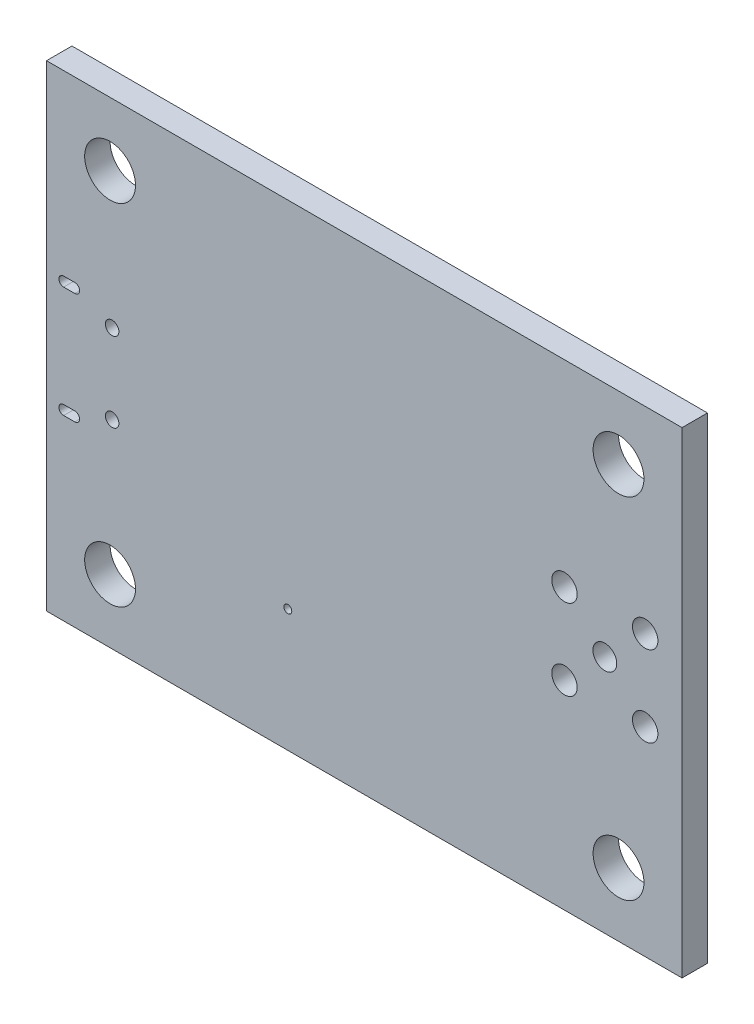
ISO-10303-21;
HEADER;
FILE_DESCRIPTION(('STEP AP214'),'2;1');
FILE_NAME('part.step','',(''),(''),'','','');
FILE_SCHEMA(('AUTOMOTIVE_DESIGN { 1 0 10303 214 1 1 1 1 }'));
ENDSEC;
DATA;
#1=APPLICATION_CONTEXT('core data for automotive mechanical design processes');
#2=APPLICATION_PROTOCOL_DEFINITION('international standard','automotive_design',2000,#1);
#3=PRODUCT_CONTEXT('',#1,'mechanical');
#4=PRODUCT('Part','Part','',(#3));
#5=PRODUCT_RELATED_PRODUCT_CATEGORY('part','',(#4));
#6=PRODUCT_DEFINITION_FORMATION('','',#4);
#7=PRODUCT_DEFINITION_CONTEXT('part definition',#1,'design');
#8=PRODUCT_DEFINITION('design','',#6,#7);
#9=PRODUCT_DEFINITION_SHAPE('','',#8);
#10=(LENGTH_UNIT() NAMED_UNIT(*) SI_UNIT(.MILLI.,.METRE.));
#11=(NAMED_UNIT(*) PLANE_ANGLE_UNIT() SI_UNIT($,.RADIAN.));
#12=(NAMED_UNIT(*) SI_UNIT($,.STERADIAN.) SOLID_ANGLE_UNIT());
#13=UNCERTAINTY_MEASURE_WITH_UNIT(LENGTH_MEASURE(1.E-05),#10,'distance_accuracy_value','');
#14=(GEOMETRIC_REPRESENTATION_CONTEXT(3) GLOBAL_UNCERTAINTY_ASSIGNED_CONTEXT((#13)) GLOBAL_UNIT_ASSIGNED_CONTEXT((#10,
#11,#12)) REPRESENTATION_CONTEXT('',''));
#15=CARTESIAN_POINT('',(0.,0.,0.));
#16=DIRECTION('',(0.,0.,1.));
#17=DIRECTION('',(1.,0.,0.));
#18=AXIS2_PLACEMENT_3D('',#15,#16,#17);
#19=CARTESIAN_POINT('',(1.0935,-11.507,0.));
#20=DIRECTION('',(0.,0.,-1.));
#21=DIRECTION('',(-1.,0.,0.));
#22=AXIS2_PLACEMENT_3D('',#19,#20,#21);
#23=CYLINDRICAL_SURFACE('',#22,0.3);
#24=CARTESIAN_POINT('',(1.0935,-11.507,1.6));
#25=DIRECTION('',(0.,0.,-1.));
#26=DIRECTION('',(-1.,0.,0.));
#27=AXIS2_PLACEMENT_3D('',#24,#25,#26);
#28=CIRCLE('',#27,0.3);
#29=CARTESIAN_POINT('',(1.0935,-11.807,1.6));
#30=VERTEX_POINT('',#29);
#31=CARTESIAN_POINT('',(1.0935,-11.207,1.6));
#32=VERTEX_POINT('',#31);
#33=EDGE_CURVE('E95',#30,#32,#28,.T.);
#34=ORIENTED_EDGE('',*,*,#33,.F.);
#35=DIRECTION('',(0.,0.,1.));
#36=VECTOR('',#35,1.);
#37=CARTESIAN_POINT('',(1.0935,-11.807,0.));
#38=LINE('',#37,#36);
#39=CARTESIAN_POINT('',(1.0935,-11.807,0.));
#40=VERTEX_POINT('',#39);
#41=EDGE_CURVE('E97',#40,#30,#38,.T.);
#42=ORIENTED_EDGE('',*,*,#41,.F.);
#43=CARTESIAN_POINT('',(1.0935,-11.507,0.));
#44=DIRECTION('',(0.,0.,-1.));
#45=DIRECTION('',(-1.,0.,0.));
#46=AXIS2_PLACEMENT_3D('',#43,#44,#45);
#47=CIRCLE('',#46,0.3);
#48=CARTESIAN_POINT('',(1.0935,-11.207,0.));
#49=VERTEX_POINT('',#48);
#50=EDGE_CURVE('E19',#49,#40,#47,.F.);
#51=ORIENTED_EDGE('',*,*,#50,.F.);
#52=DIRECTION('',(0.,0.,-1.));
#53=VECTOR('',#52,1.);
#54=CARTESIAN_POINT('',(1.0935,-11.207,0.));
#55=LINE('',#54,#53);
#56=EDGE_CURVE('E114',#32,#49,#55,.T.);
#57=ORIENTED_EDGE('',*,*,#56,.F.);
#58=EDGE_LOOP('',(#34,#42,#51,#57));
#59=FACE_BOUND('',#58,.T.);
#60=ADVANCED_FACE('F16',(#59),#23,.F.);
#61=CARTESIAN_POINT('',(1.7935,-18.507,0.));
#62=DIRECTION('',(0.,0.,-1.));
#63=DIRECTION('',(-1.,0.,0.));
#64=AXIS2_PLACEMENT_3D('',#61,#62,#63);
#65=CYLINDRICAL_SURFACE('',#64,0.3);
#66=CARTESIAN_POINT('',(1.7935,-18.507,1.6));
#67=DIRECTION('',(0.,0.,-1.));
#68=DIRECTION('',(-1.,0.,0.));
#69=AXIS2_PLACEMENT_3D('',#66,#67,#68);
#70=CIRCLE('',#69,0.3);
#71=CARTESIAN_POINT('',(1.7935,-18.207,1.6));
#72=VERTEX_POINT('',#71);
#73=CARTESIAN_POINT('',(1.7935,-18.807,1.6));
#74=VERTEX_POINT('',#73);
#75=EDGE_CURVE('E118',#72,#74,#70,.T.);
#76=ORIENTED_EDGE('',*,*,#75,.F.);
#77=DIRECTION('',(0.,0.,-1.));
#78=VECTOR('',#77,1.);
#79=CARTESIAN_POINT('',(1.7935,-18.207,0.));
#80=LINE('',#79,#78);
#81=CARTESIAN_POINT('',(1.7935,-18.207,0.));
#82=VERTEX_POINT('',#81);
#83=EDGE_CURVE('E115',#82,#72,#80,.F.);
#84=ORIENTED_EDGE('',*,*,#83,.F.);
#85=CARTESIAN_POINT('',(1.7935,-18.507,0.));
#86=DIRECTION('',(0.,0.,-1.));
#87=DIRECTION('',(-1.,0.,0.));
#88=AXIS2_PLACEMENT_3D('',#85,#86,#87);
#89=CIRCLE('',#88,0.3);
#90=CARTESIAN_POINT('',(1.7935,-18.807,0.));
#91=VERTEX_POINT('',#90);
#92=EDGE_CURVE('E205',#91,#82,#89,.F.);
#93=ORIENTED_EDGE('',*,*,#92,.F.);
#94=DIRECTION('',(0.,0.,1.));
#95=VECTOR('',#94,1.);
#96=CARTESIAN_POINT('',(1.7935,-18.807,0.));
#97=LINE('',#96,#95);
#98=EDGE_CURVE('E105',#74,#91,#97,.F.);
#99=ORIENTED_EDGE('',*,*,#98,.F.);
#100=EDGE_LOOP('',(#76,#84,#93,#99));
#101=FACE_BOUND('',#100,.T.);
#102=ADVANCED_FACE('F242',(#101),#65,.F.);
#103=CARTESIAN_POINT('',(1.7935,-11.207,0.));
#104=DIRECTION('',(0.,-1.,0.));
#105=DIRECTION('',(0.,0.,-1.));
#106=AXIS2_PLACEMENT_3D('',#103,#104,#105);
#107=PLANE('',#106);
#108=ORIENTED_EDGE('',*,*,#56,.T.);
#109=DIRECTION('',(1.,0.,0.));
#110=VECTOR('',#109,1.);
#111=CARTESIAN_POINT('',(1.7935,-11.207,0.));
#112=LINE('',#111,#110);
#113=CARTESIAN_POINT('',(1.7935,-11.207,0.));
#114=VERTEX_POINT('',#113);
#115=EDGE_CURVE('E93',#49,#114,#112,.T.);
#116=ORIENTED_EDGE('',*,*,#115,.T.);
#117=DIRECTION('',(0.,0.,-1.));
#118=VECTOR('',#117,1.);
#119=CARTESIAN_POINT('',(1.7935,-11.207,0.));
#120=LINE('',#119,#118);
#121=CARTESIAN_POINT('',(1.7935,-11.207,1.6));
#122=VERTEX_POINT('',#121);
#123=EDGE_CURVE('E181',#114,#122,#120,.F.);
#124=ORIENTED_EDGE('',*,*,#123,.T.);
#125=DIRECTION('',(-1.,0.,0.));
#126=VECTOR('',#125,1.);
#127=CARTESIAN_POINT('',(20.014,-11.207,1.6));
#128=LINE('',#127,#126);
#129=EDGE_CURVE('E211',#122,#32,#128,.T.);
#130=ORIENTED_EDGE('',*,*,#129,.T.);
#131=EDGE_LOOP('',(#108,#116,#124,#130));
#132=FACE_BOUND('',#131,.T.);
#133=ADVANCED_FACE('F215',(#132),#107,.T.);
#134=CARTESIAN_POINT('',(1.0935,-11.807,0.));
#135=DIRECTION('',(0.,1.,0.));
#136=DIRECTION('',(0.,0.,1.));
#137=AXIS2_PLACEMENT_3D('',#134,#135,#136);
#138=PLANE('',#137);
#139=DIRECTION('',(0.,0.,-1.));
#140=VECTOR('',#139,1.);
#141=CARTESIAN_POINT('',(1.7935,-11.807,0.));
#142=LINE('',#141,#140);
#143=CARTESIAN_POINT('',(1.7935,-11.807,1.6));
#144=VERTEX_POINT('',#143);
#145=CARTESIAN_POINT('',(1.7935,-11.807,0.));
#146=VERTEX_POINT('',#145);
#147=EDGE_CURVE('E103',#144,#146,#142,.T.);
#148=ORIENTED_EDGE('',*,*,#147,.T.);
#149=DIRECTION('',(1.,0.,0.));
#150=VECTOR('',#149,1.);
#151=CARTESIAN_POINT('',(1.0935,-11.807,0.));
#152=LINE('',#151,#150);
#153=EDGE_CURVE('E91',#146,#40,#152,.F.);
#154=ORIENTED_EDGE('',*,*,#153,.T.);
#155=ORIENTED_EDGE('',*,*,#41,.T.);
#156=DIRECTION('',(-1.,0.,0.));
#157=VECTOR('',#156,1.);
#158=CARTESIAN_POINT('',(20.014,-11.807,1.6));
#159=LINE('',#158,#157);
#160=EDGE_CURVE('E213',#30,#144,#159,.F.);
#161=ORIENTED_EDGE('',*,*,#160,.T.);
#162=EDGE_LOOP('',(#148,#154,#155,#161));
#163=FACE_BOUND('',#162,.T.);
#164=ADVANCED_FACE('F101',(#163),#138,.T.);
#165=CARTESIAN_POINT('',(1.0935,-18.807,0.));
#166=DIRECTION('',(0.,1.,0.));
#167=DIRECTION('',(0.,0.,1.));
#168=AXIS2_PLACEMENT_3D('',#165,#166,#167);
#169=PLANE('',#168);
#170=ORIENTED_EDGE('',*,*,#98,.T.);
#171=DIRECTION('',(1.,0.,0.));
#172=VECTOR('',#171,1.);
#173=CARTESIAN_POINT('',(1.0935,-18.807,0.));
#174=LINE('',#173,#172);
#175=CARTESIAN_POINT('',(1.0935,-18.807,0.));
#176=VERTEX_POINT('',#175);
#177=EDGE_CURVE('E108',#91,#176,#174,.F.);
#178=ORIENTED_EDGE('',*,*,#177,.T.);
#179=DIRECTION('',(0.,0.,-1.));
#180=VECTOR('',#179,1.);
#181=CARTESIAN_POINT('',(1.0935,-18.807,0.));
#182=LINE('',#181,#180);
#183=CARTESIAN_POINT('',(1.0935,-18.807,1.6));
#184=VERTEX_POINT('',#183);
#185=EDGE_CURVE('E174',#176,#184,#182,.F.);
#186=ORIENTED_EDGE('',*,*,#185,.T.);
#187=DIRECTION('',(-1.,0.,0.));
#188=VECTOR('',#187,1.);
#189=CARTESIAN_POINT('',(20.014,-18.807,1.6));
#190=LINE('',#189,#188);
#191=EDGE_CURVE('E217',#184,#74,#190,.F.);
#192=ORIENTED_EDGE('',*,*,#191,.T.);
#193=EDGE_LOOP('',(#170,#178,#186,#192));
#194=FACE_BOUND('',#193,.T.);
#195=ADVANCED_FACE('F239',(#194),#169,.T.);
#196=CARTESIAN_POINT('',(1.7935,-18.207,0.));
#197=DIRECTION('',(0.,-1.,0.));
#198=DIRECTION('',(0.,0.,-1.));
#199=AXIS2_PLACEMENT_3D('',#196,#197,#198);
#200=PLANE('',#199);
#201=DIRECTION('',(0.,0.,-1.));
#202=VECTOR('',#201,1.);
#203=CARTESIAN_POINT('',(1.0935,-18.207,0.));
#204=LINE('',#203,#202);
#205=CARTESIAN_POINT('',(1.0935,-18.207,1.6));
#206=VERTEX_POINT('',#205);
#207=CARTESIAN_POINT('',(1.0935,-18.207,0.));
#208=VERTEX_POINT('',#207);
#209=EDGE_CURVE('E170',#206,#208,#204,.T.);
#210=ORIENTED_EDGE('',*,*,#209,.T.);
#211=DIRECTION('',(1.,0.,0.));
#212=VECTOR('',#211,1.);
#213=CARTESIAN_POINT('',(1.7935,-18.207,0.));
#214=LINE('',#213,#212);
#215=EDGE_CURVE('E34',#208,#82,#214,.T.);
#216=ORIENTED_EDGE('',*,*,#215,.T.);
#217=ORIENTED_EDGE('',*,*,#83,.T.);
#218=DIRECTION('',(-1.,0.,0.));
#219=VECTOR('',#218,1.);
#220=CARTESIAN_POINT('',(20.014,-18.207,1.6));
#221=LINE('',#220,#219);
#222=EDGE_CURVE('E220',#72,#206,#221,.T.);
#223=ORIENTED_EDGE('',*,*,#222,.T.);
#224=EDGE_LOOP('',(#210,#216,#217,#223));
#225=FACE_BOUND('',#224,.T.);
#226=ADVANCED_FACE('F225',(#225),#200,.T.);
#227=CARTESIAN_POINT('',(20.014,-15.007,1.6));
#228=DIRECTION('',(0.,0.,-1.));
#229=DIRECTION('',(-1.,0.,0.));
#230=AXIS2_PLACEMENT_3D('',#227,#228,#229);
#231=PLANE('',#230);
#232=CARTESIAN_POINT('',(36.014,-4.007,1.6));
#233=DIRECTION('',(0.,0.,1.));
#234=DIRECTION('',(1.,0.,0.));
#235=AXIS2_PLACEMENT_3D('',#232,#233,#234);
#236=CIRCLE('',#235,1.6);
#237=CARTESIAN_POINT('',(37.614,-4.007,1.6));
#238=VERTEX_POINT('',#237);
#239=EDGE_CURVE('E157',#238,#238,#236,.F.);
#240=ORIENTED_EDGE('',*,*,#239,.T.);
#241=EDGE_LOOP('',(#240));
#242=FACE_BOUND('',#241,.T.);
#243=CARTESIAN_POINT('',(4.014,-4.007,1.6));
#244=DIRECTION('',(0.,0.,1.));
#245=DIRECTION('',(1.,0.,0.));
#246=AXIS2_PLACEMENT_3D('',#243,#244,#245);
#247=CIRCLE('',#246,1.6);
#248=CARTESIAN_POINT('',(5.614,-4.007,1.6));
#249=VERTEX_POINT('',#248);
#250=EDGE_CURVE('E161',#249,#249,#247,.F.);
#251=ORIENTED_EDGE('',*,*,#250,.T.);
#252=EDGE_LOOP('',(#251));
#253=FACE_BOUND('',#252,.T.);
#254=CARTESIAN_POINT('',(37.6936,-12.3952,1.6));
#255=DIRECTION('',(0.,0.,1.));
#256=DIRECTION('',(1.,0.,0.));
#257=AXIS2_PLACEMENT_3D('',#254,#255,#256);
#258=CIRCLE('',#257,0.8);
#259=CARTESIAN_POINT('',(38.4936,-12.3952,1.6));
#260=VERTEX_POINT('',#259);
#261=EDGE_CURVE('E182',#260,#260,#258,.F.);
#262=ORIENTED_EDGE('',*,*,#261,.T.);
#263=EDGE_LOOP('',(#262));
#264=FACE_BOUND('',#263,.T.);
#265=CARTESIAN_POINT('',(35.1536,-14.9352,1.6));
#266=DIRECTION('',(0.,0.,1.));
#267=DIRECTION('',(1.,0.,0.));
#268=AXIS2_PLACEMENT_3D('',#265,#266,#267);
#269=CIRCLE('',#268,0.75);
#270=CARTESIAN_POINT('',(35.9036,-14.9352,1.6));
#271=VERTEX_POINT('',#270);
#272=EDGE_CURVE('E188',#271,#271,#269,.F.);
#273=ORIENTED_EDGE('',*,*,#272,.T.);
#274=EDGE_LOOP('',(#273));
#275=FACE_BOUND('',#274,.T.);
#276=CARTESIAN_POINT('',(37.6936,-17.4752,1.6));
#277=DIRECTION('',(0.,0.,1.));
#278=DIRECTION('',(1.,0.,0.));
#279=AXIS2_PLACEMENT_3D('',#276,#277,#278);
#280=CIRCLE('',#279,0.8);
#281=CARTESIAN_POINT('',(38.4936,-17.4752,1.6));
#282=VERTEX_POINT('',#281);
#283=EDGE_CURVE('E185',#282,#282,#280,.F.);
#284=ORIENTED_EDGE('',*,*,#283,.T.);
#285=EDGE_LOOP('',(#284));
#286=FACE_BOUND('',#285,.T.);
#287=CARTESIAN_POINT('',(36.014,-26.007,1.6));
#288=DIRECTION('',(0.,0.,1.));
#289=DIRECTION('',(1.,0.,0.));
#290=AXIS2_PLACEMENT_3D('',#287,#288,#289);
#291=CIRCLE('',#290,1.6);
#292=CARTESIAN_POINT('',(37.614,-26.007,1.6));
#293=VERTEX_POINT('',#292);
#294=EDGE_CURVE('E191',#293,#293,#291,.F.);
#295=ORIENTED_EDGE('',*,*,#294,.T.);
#296=EDGE_LOOP('',(#295));
#297=FACE_BOUND('',#296,.T.);
#298=CARTESIAN_POINT('',(15.2,-22.3,1.6));
#299=DIRECTION('',(0.,0.,1.));
#300=DIRECTION('',(1.,0.,0.));
#301=AXIS2_PLACEMENT_3D('',#298,#299,#300);
#302=CIRCLE('',#301,0.25);
#303=CARTESIAN_POINT('',(15.45,-22.3,1.6));
#304=VERTEX_POINT('',#303);
#305=EDGE_CURVE('E194',#304,#304,#302,.F.);
#306=ORIENTED_EDGE('',*,*,#305,.T.);
#307=EDGE_LOOP('',(#306));
#308=FACE_BOUND('',#307,.T.);
#309=CARTESIAN_POINT('',(32.6136,-17.4752,1.6));
#310=DIRECTION('',(0.,0.,1.));
#311=DIRECTION('',(1.,0.,0.));
#312=AXIS2_PLACEMENT_3D('',#309,#310,#311);
#313=CIRCLE('',#312,0.8);
#314=CARTESIAN_POINT('',(33.4136,-17.4752,1.6));
#315=VERTEX_POINT('',#314);
#316=EDGE_CURVE('E200',#315,#315,#313,.F.);
#317=ORIENTED_EDGE('',*,*,#316,.T.);
#318=EDGE_LOOP('',(#317));
#319=FACE_BOUND('',#318,.T.);
#320=CARTESIAN_POINT('',(32.6136,-12.3952,1.6));
#321=DIRECTION('',(0.,0.,1.));
#322=DIRECTION('',(1.,0.,0.));
#323=AXIS2_PLACEMENT_3D('',#320,#321,#322);
#324=CIRCLE('',#323,0.8);
#325=CARTESIAN_POINT('',(33.4136,-12.3952,1.6));
#326=VERTEX_POINT('',#325);
#327=EDGE_CURVE('E197',#326,#326,#324,.F.);
#328=ORIENTED_EDGE('',*,*,#327,.T.);
#329=EDGE_LOOP('',(#328));
#330=FACE_BOUND('',#329,.T.);
#331=CARTESIAN_POINT('',(4.014,-26.007,1.6));
#332=DIRECTION('',(0.,0.,1.));
#333=DIRECTION('',(1.,0.,0.));
#334=AXIS2_PLACEMENT_3D('',#331,#332,#333);
#335=CIRCLE('',#334,1.6);
#336=CARTESIAN_POINT('',(5.614,-26.007,1.6));
#337=VERTEX_POINT('',#336);
#338=EDGE_CURVE('E164',#337,#337,#335,.F.);
#339=ORIENTED_EDGE('',*,*,#338,.T.);
#340=EDGE_LOOP('',(#339));
#341=FACE_BOUND('',#340,.T.);
#342=ORIENTED_EDGE('',*,*,#222,.F.);
#343=ORIENTED_EDGE('',*,*,#75,.T.);
#344=ORIENTED_EDGE('',*,*,#191,.F.);
#345=CARTESIAN_POINT('',(1.0935,-18.507,1.6));
#346=DIRECTION('',(0.,0.,-1.));
#347=DIRECTION('',(-1.,0.,0.));
#348=AXIS2_PLACEMENT_3D('',#345,#346,#347);
#349=CIRCLE('',#348,0.3);
#350=EDGE_CURVE('E171',#184,#206,#349,.T.);
#351=ORIENTED_EDGE('',*,*,#350,.T.);
#352=EDGE_LOOP('',(#342,#343,#344,#351));
#353=FACE_BOUND('',#352,.T.);
#354=CARTESIAN_POINT('',(4.1435,-17.507,1.6));
#355=DIRECTION('',(0.,0.,1.));
#356=DIRECTION('',(1.,0.,0.));
#357=AXIS2_PLACEMENT_3D('',#354,#355,#356);
#358=CIRCLE('',#357,0.425);
#359=CARTESIAN_POINT('',(4.5685,-17.507,1.6));
#360=VERTEX_POINT('',#359);
#361=EDGE_CURVE('E167',#360,#360,#358,.F.);
#362=ORIENTED_EDGE('',*,*,#361,.T.);
#363=EDGE_LOOP('',(#362));
#364=FACE_BOUND('',#363,.T.);
#365=CARTESIAN_POINT('',(4.1435,-12.507,1.6));
#366=DIRECTION('',(0.,0.,1.));
#367=DIRECTION('',(1.,0.,0.));
#368=AXIS2_PLACEMENT_3D('',#365,#366,#367);
#369=CIRCLE('',#368,0.425);
#370=CARTESIAN_POINT('',(4.5685,-12.507,1.6));
#371=VERTEX_POINT('',#370);
#372=EDGE_CURVE('E175',#371,#371,#369,.F.);
#373=ORIENTED_EDGE('',*,*,#372,.T.);
#374=EDGE_LOOP('',(#373));
#375=FACE_BOUND('',#374,.T.);
#376=ORIENTED_EDGE('',*,*,#129,.F.);
#377=CARTESIAN_POINT('',(1.7935,-11.507,1.6));
#378=DIRECTION('',(0.,0.,-1.));
#379=DIRECTION('',(-1.,0.,0.));
#380=AXIS2_PLACEMENT_3D('',#377,#378,#379);
#381=CIRCLE('',#380,0.3);
#382=EDGE_CURVE('E178',#122,#144,#381,.T.);
#383=ORIENTED_EDGE('',*,*,#382,.T.);
#384=ORIENTED_EDGE('',*,*,#160,.F.);
#385=ORIENTED_EDGE('',*,*,#33,.T.);
#386=EDGE_LOOP('',(#376,#383,#384,#385));
#387=FACE_BOUND('',#386,.T.);
#388=DIRECTION('',(1.,0.,0.));
#389=VECTOR('',#388,1.);
#390=CARTESIAN_POINT('',(0.014,-0.007,1.6));
#391=LINE('',#390,#389);
#392=CARTESIAN_POINT('',(0.014,-0.00700000000000005,1.6));
#393=VERTEX_POINT('',#392);
#394=CARTESIAN_POINT('',(40.014,-0.00700000000000002,1.6));
#395=VERTEX_POINT('',#394);
#396=EDGE_CURVE('E258',#393,#395,#391,.T.);
#397=ORIENTED_EDGE('',*,*,#396,.F.);
#398=DIRECTION('',(0.,1.,0.));
#399=VECTOR('',#398,1.);
#400=CARTESIAN_POINT('',(0.014,-30.007,1.6));
#401=LINE('',#400,#399);
#402=CARTESIAN_POINT('',(0.0140000000000001,-30.007,1.6));
#403=VERTEX_POINT('',#402);
#404=EDGE_CURVE('E252',#403,#393,#401,.T.);
#405=ORIENTED_EDGE('',*,*,#404,.F.);
#406=DIRECTION('',(1.,0.,0.));
#407=VECTOR('',#406,1.);
#408=CARTESIAN_POINT('',(40.014,-30.007,1.6));
#409=LINE('',#408,#407);
#410=CARTESIAN_POINT('',(40.014,-30.007,1.6));
#411=VERTEX_POINT('',#410);
#412=EDGE_CURVE('E245',#411,#403,#409,.F.);
#413=ORIENTED_EDGE('',*,*,#412,.F.);
#414=DIRECTION('',(0.,1.,0.));
#415=VECTOR('',#414,1.);
#416=CARTESIAN_POINT('',(40.014,-0.007,1.6));
#417=LINE('',#416,#415);
#418=EDGE_CURVE('E264',#395,#411,#417,.F.);
#419=ORIENTED_EDGE('',*,*,#418,.F.);
#420=EDGE_LOOP('',(#397,#405,#413,#419));
#421=FACE_BOUND('',#420,.T.);
#422=ADVANCED_FACE('F208',(#242,#253,#264,#275,#286,#297,#308,#319,#330,#341,#353,#364,#375,
#387,#421),#231,.F.);
#423=CARTESIAN_POINT('',(40.014,-30.007,0.));
#424=DIRECTION('',(0.,-1.,0.));
#425=DIRECTION('',(0.,0.,-1.));
#426=AXIS2_PLACEMENT_3D('',#423,#424,#425);
#427=PLANE('',#426);
#428=DIRECTION('',(0.,0.,1.));
#429=VECTOR('',#428,1.);
#430=CARTESIAN_POINT('',(0.014,-30.007,0.));
#431=LINE('',#430,#429);
#432=CARTESIAN_POINT('',(0.0140000000000001,-30.007,0.));
#433=VERTEX_POINT('',#432);
#434=EDGE_CURVE('E247',#433,#403,#431,.T.);
#435=ORIENTED_EDGE('',*,*,#434,.F.);
#436=DIRECTION('',(-1.,0.,0.));
#437=VECTOR('',#436,1.);
#438=CARTESIAN_POINT('',(20.014,-30.007,0.));
#439=LINE('',#438,#437);
#440=CARTESIAN_POINT('',(40.014,-30.007,0.));
#441=VERTEX_POINT('',#440);
#442=EDGE_CURVE('E160',#441,#433,#439,.T.);
#443=ORIENTED_EDGE('',*,*,#442,.F.);
#444=DIRECTION('',(0.,0.,-1.));
#445=VECTOR('',#444,1.);
#446=CARTESIAN_POINT('',(40.014,-30.007,0.));
#447=LINE('',#446,#445);
#448=EDGE_CURVE('E203',#411,#441,#447,.T.);
#449=ORIENTED_EDGE('',*,*,#448,.F.);
#450=ORIENTED_EDGE('',*,*,#412,.T.);
#451=EDGE_LOOP('',(#435,#443,#449,#450));
#452=FACE_BOUND('',#451,.T.);
#453=ADVANCED_FACE('F307',(#452),#427,.T.);
#454=CARTESIAN_POINT('',(0.014,-30.007,0.));
#455=DIRECTION('',(-1.,0.,0.));
#456=DIRECTION('',(0.,0.,1.));
#457=AXIS2_PLACEMENT_3D('',#454,#455,#456);
#458=PLANE('',#457);
#459=DIRECTION('',(0.,0.,1.));
#460=VECTOR('',#459,1.);
#461=CARTESIAN_POINT('',(0.014,-0.007,0.));
#462=LINE('',#461,#460);
#463=CARTESIAN_POINT('',(0.014,-0.00700000000000005,0.));
#464=VERTEX_POINT('',#463);
#465=EDGE_CURVE('E255',#464,#393,#462,.T.);
#466=ORIENTED_EDGE('',*,*,#465,.F.);
#467=DIRECTION('',(0.,1.,0.));
#468=VECTOR('',#467,1.);
#469=CARTESIAN_POINT('',(0.0140000000000001,-15.007,0.));
#470=LINE('',#469,#468);
#471=EDGE_CURVE('E274',#433,#464,#470,.T.);
#472=ORIENTED_EDGE('',*,*,#471,.F.);
#473=ORIENTED_EDGE('',*,*,#434,.T.);
#474=ORIENTED_EDGE('',*,*,#404,.T.);
#475=EDGE_LOOP('',(#466,#472,#473,#474));
#476=FACE_BOUND('',#475,.T.);
#477=ADVANCED_FACE('F310',(#476),#458,.T.);
#478=CARTESIAN_POINT('',(0.014,-0.007,0.));
#479=DIRECTION('',(0.,1.,0.));
#480=DIRECTION('',(0.,0.,1.));
#481=AXIS2_PLACEMENT_3D('',#478,#479,#480);
#482=PLANE('',#481);
#483=DIRECTION('',(0.,0.,-1.));
#484=VECTOR('',#483,1.);
#485=CARTESIAN_POINT('',(40.014,-0.007,0.));
#486=LINE('',#485,#484);
#487=CARTESIAN_POINT('',(40.014,-0.00700000000000002,0.));
#488=VERTEX_POINT('',#487);
#489=EDGE_CURVE('E261',#488,#395,#486,.F.);
#490=ORIENTED_EDGE('',*,*,#489,.F.);
#491=DIRECTION('',(-1.,0.,0.));
#492=VECTOR('',#491,1.);
#493=CARTESIAN_POINT('',(20.014,-0.00700000000000006,0.));
#494=LINE('',#493,#492);
#495=EDGE_CURVE('E277',#464,#488,#494,.F.);
#496=ORIENTED_EDGE('',*,*,#495,.F.);
#497=ORIENTED_EDGE('',*,*,#465,.T.);
#498=ORIENTED_EDGE('',*,*,#396,.T.);
#499=EDGE_LOOP('',(#490,#496,#497,#498));
#500=FACE_BOUND('',#499,.T.);
#501=ADVANCED_FACE('F311',(#500),#482,.T.);
#502=CARTESIAN_POINT('',(40.014,-0.007,0.));
#503=DIRECTION('',(1.,0.,0.));
#504=DIRECTION('',(0.,0.,-1.));
#505=AXIS2_PLACEMENT_3D('',#502,#503,#504);
#506=PLANE('',#505);
#507=ORIENTED_EDGE('',*,*,#448,.T.);
#508=DIRECTION('',(0.,1.,0.));
#509=VECTOR('',#508,1.);
#510=CARTESIAN_POINT('',(40.014,-15.007,0.));
#511=LINE('',#510,#509);
#512=EDGE_CURVE('E156',#488,#441,#511,.F.);
#513=ORIENTED_EDGE('',*,*,#512,.F.);
#514=ORIENTED_EDGE('',*,*,#489,.T.);
#515=ORIENTED_EDGE('',*,*,#418,.T.);
#516=EDGE_LOOP('',(#507,#513,#514,#515));
#517=FACE_BOUND('',#516,.T.);
#518=ADVANCED_FACE('F288',(#517),#506,.T.);
#519=CARTESIAN_POINT('',(32.6136,-17.4752,-0.8));
#520=DIRECTION('',(0.,0.,1.));
#521=DIRECTION('',(1.,0.,0.));
#522=AXIS2_PLACEMENT_3D('',#519,#520,#521);
#523=CYLINDRICAL_SURFACE('',#522,0.8);
#524=CARTESIAN_POINT('',(32.6136,-17.4752,0.));
#525=DIRECTION('',(0.,0.,1.));
#526=DIRECTION('',(1.,0.,0.));
#527=AXIS2_PLACEMENT_3D('',#524,#525,#526);
#528=CIRCLE('',#527,0.8);
#529=CARTESIAN_POINT('',(33.4136,-17.4752,0.));
#530=VERTEX_POINT('',#529);
#531=EDGE_CURVE('E153',#530,#530,#528,.T.);
#532=ORIENTED_EDGE('',*,*,#531,.F.);
#533=EDGE_LOOP('',(#532));
#534=FACE_BOUND('',#533,.T.);
#535=ORIENTED_EDGE('',*,*,#316,.F.);
#536=EDGE_LOOP('',(#535));
#537=FACE_BOUND('',#536,.T.);
#538=ADVANCED_FACE('F319',(#534,#537),#523,.F.);
#539=CARTESIAN_POINT('',(32.6136,-12.3952,-0.8));
#540=DIRECTION('',(0.,0.,1.));
#541=DIRECTION('',(1.,0.,0.));
#542=AXIS2_PLACEMENT_3D('',#539,#540,#541);
#543=CYLINDRICAL_SURFACE('',#542,0.8);
#544=CARTESIAN_POINT('',(32.6136,-12.3952,0.));
#545=DIRECTION('',(0.,0.,1.));
#546=DIRECTION('',(1.,0.,0.));
#547=AXIS2_PLACEMENT_3D('',#544,#545,#546);
#548=CIRCLE('',#547,0.8);
#549=CARTESIAN_POINT('',(33.4136,-12.3952,0.));
#550=VERTEX_POINT('',#549);
#551=EDGE_CURVE('E150',#550,#550,#548,.T.);
#552=ORIENTED_EDGE('',*,*,#551,.F.);
#553=EDGE_LOOP('',(#552));
#554=FACE_BOUND('',#553,.T.);
#555=ORIENTED_EDGE('',*,*,#327,.F.);
#556=EDGE_LOOP('',(#555));
#557=FACE_BOUND('',#556,.T.);
#558=ADVANCED_FACE('F374',(#554,#557),#543,.F.);
#559=CARTESIAN_POINT('',(15.2,-22.3,-0.8));
#560=DIRECTION('',(0.,0.,1.));
#561=DIRECTION('',(1.,0.,0.));
#562=AXIS2_PLACEMENT_3D('',#559,#560,#561);
#563=CYLINDRICAL_SURFACE('',#562,0.25);
#564=CARTESIAN_POINT('',(15.2,-22.3,0.));
#565=DIRECTION('',(0.,0.,1.));
#566=DIRECTION('',(1.,0.,0.));
#567=AXIS2_PLACEMENT_3D('',#564,#565,#566);
#568=CIRCLE('',#567,0.25);
#569=CARTESIAN_POINT('',(15.45,-22.3,0.));
#570=VERTEX_POINT('',#569);
#571=EDGE_CURVE('E147',#570,#570,#568,.T.);
#572=ORIENTED_EDGE('',*,*,#571,.F.);
#573=EDGE_LOOP('',(#572));
#574=FACE_BOUND('',#573,.T.);
#575=ORIENTED_EDGE('',*,*,#305,.F.);
#576=EDGE_LOOP('',(#575));
#577=FACE_BOUND('',#576,.T.);
#578=ADVANCED_FACE('F370',(#574,#577),#563,.F.);
#579=CARTESIAN_POINT('',(36.014,-26.007,-0.8));
#580=DIRECTION('',(0.,0.,1.));
#581=DIRECTION('',(1.,0.,0.));
#582=AXIS2_PLACEMENT_3D('',#579,#580,#581);
#583=CYLINDRICAL_SURFACE('',#582,1.6);
#584=CARTESIAN_POINT('',(36.014,-26.007,0.));
#585=DIRECTION('',(0.,0.,1.));
#586=DIRECTION('',(1.,0.,0.));
#587=AXIS2_PLACEMENT_3D('',#584,#585,#586);
#588=CIRCLE('',#587,1.6);
#589=CARTESIAN_POINT('',(37.614,-26.007,0.));
#590=VERTEX_POINT('',#589);
#591=EDGE_CURVE('E144',#590,#590,#588,.T.);
#592=ORIENTED_EDGE('',*,*,#591,.F.);
#593=EDGE_LOOP('',(#592));
#594=FACE_BOUND('',#593,.T.);
#595=ORIENTED_EDGE('',*,*,#294,.F.);
#596=EDGE_LOOP('',(#595));
#597=FACE_BOUND('',#596,.T.);
#598=ADVANCED_FACE('F366',(#594,#597),#583,.F.);
#599=CARTESIAN_POINT('',(35.1536,-14.9352,-0.8));
#600=DIRECTION('',(0.,0.,1.));
#601=DIRECTION('',(1.,0.,0.));
#602=AXIS2_PLACEMENT_3D('',#599,#600,#601);
#603=CYLINDRICAL_SURFACE('',#602,0.75);
#604=CARTESIAN_POINT('',(35.1536,-14.9352,0.));
#605=DIRECTION('',(0.,0.,1.));
#606=DIRECTION('',(1.,0.,0.));
#607=AXIS2_PLACEMENT_3D('',#604,#605,#606);
#608=CIRCLE('',#607,0.75);
#609=CARTESIAN_POINT('',(35.9036,-14.9352,0.));
#610=VERTEX_POINT('',#609);
#611=EDGE_CURVE('E141',#610,#610,#608,.T.);
#612=ORIENTED_EDGE('',*,*,#611,.F.);
#613=EDGE_LOOP('',(#612));
#614=FACE_BOUND('',#613,.T.);
#615=ORIENTED_EDGE('',*,*,#272,.F.);
#616=EDGE_LOOP('',(#615));
#617=FACE_BOUND('',#616,.T.);
#618=ADVANCED_FACE('F362',(#614,#617),#603,.F.);
#619=CARTESIAN_POINT('',(37.6936,-17.4752,-0.8));
#620=DIRECTION('',(0.,0.,1.));
#621=DIRECTION('',(1.,0.,0.));
#622=AXIS2_PLACEMENT_3D('',#619,#620,#621);
#623=CYLINDRICAL_SURFACE('',#622,0.8);
#624=CARTESIAN_POINT('',(37.6936,-17.4752,0.));
#625=DIRECTION('',(0.,0.,1.));
#626=DIRECTION('',(1.,0.,0.));
#627=AXIS2_PLACEMENT_3D('',#624,#625,#626);
#628=CIRCLE('',#627,0.8);
#629=CARTESIAN_POINT('',(38.4936,-17.4752,0.));
#630=VERTEX_POINT('',#629);
#631=EDGE_CURVE('E138',#630,#630,#628,.T.);
#632=ORIENTED_EDGE('',*,*,#631,.F.);
#633=EDGE_LOOP('',(#632));
#634=FACE_BOUND('',#633,.T.);
#635=ORIENTED_EDGE('',*,*,#283,.F.);
#636=EDGE_LOOP('',(#635));
#637=FACE_BOUND('',#636,.T.);
#638=ADVANCED_FACE('F358',(#634,#637),#623,.F.);
#639=CARTESIAN_POINT('',(37.6936,-12.3952,-0.8));
#640=DIRECTION('',(0.,0.,1.));
#641=DIRECTION('',(1.,0.,0.));
#642=AXIS2_PLACEMENT_3D('',#639,#640,#641);
#643=CYLINDRICAL_SURFACE('',#642,0.8);
#644=CARTESIAN_POINT('',(37.6936,-12.3952,0.));
#645=DIRECTION('',(0.,0.,1.));
#646=DIRECTION('',(1.,0.,0.));
#647=AXIS2_PLACEMENT_3D('',#644,#645,#646);
#648=CIRCLE('',#647,0.8);
#649=CARTESIAN_POINT('',(38.4936,-12.3952,0.));
#650=VERTEX_POINT('',#649);
#651=EDGE_CURVE('E135',#650,#650,#648,.T.);
#652=ORIENTED_EDGE('',*,*,#651,.F.);
#653=EDGE_LOOP('',(#652));
#654=FACE_BOUND('',#653,.T.);
#655=ORIENTED_EDGE('',*,*,#261,.F.);
#656=EDGE_LOOP('',(#655));
#657=FACE_BOUND('',#656,.T.);
#658=ADVANCED_FACE('F354',(#654,#657),#643,.F.);
#659=CARTESIAN_POINT('',(1.7935,-11.507,0.));
#660=DIRECTION('',(0.,0.,-1.));
#661=DIRECTION('',(-1.,0.,0.));
#662=AXIS2_PLACEMENT_3D('',#659,#660,#661);
#663=CYLINDRICAL_SURFACE('',#662,0.3);
#664=ORIENTED_EDGE('',*,*,#382,.F.);
#665=ORIENTED_EDGE('',*,*,#123,.F.);
#666=CARTESIAN_POINT('',(1.7935,-11.507,0.));
#667=DIRECTION('',(0.,0.,-1.));
#668=DIRECTION('',(-1.,0.,0.));
#669=AXIS2_PLACEMENT_3D('',#666,#667,#668);
#670=CIRCLE('',#669,0.3);
#671=EDGE_CURVE('E133',#146,#114,#670,.F.);
#672=ORIENTED_EDGE('',*,*,#671,.F.);
#673=ORIENTED_EDGE('',*,*,#147,.F.);
#674=EDGE_LOOP('',(#664,#665,#672,#673));
#675=FACE_BOUND('',#674,.T.);
#676=ADVANCED_FACE('F350',(#675),#663,.F.);
#677=CARTESIAN_POINT('',(4.1435,-12.507,-0.8));
#678=DIRECTION('',(0.,0.,1.));
#679=DIRECTION('',(1.,0.,0.));
#680=AXIS2_PLACEMENT_3D('',#677,#678,#679);
#681=CYLINDRICAL_SURFACE('',#680,0.425);
#682=CARTESIAN_POINT('',(4.1435,-12.507,0.));
#683=DIRECTION('',(0.,0.,1.));
#684=DIRECTION('',(1.,0.,0.));
#685=AXIS2_PLACEMENT_3D('',#682,#683,#684);
#686=CIRCLE('',#685,0.425);
#687=CARTESIAN_POINT('',(4.5685,-12.507,0.));
#688=VERTEX_POINT('',#687);
#689=EDGE_CURVE('E130',#688,#688,#686,.T.);
#690=ORIENTED_EDGE('',*,*,#689,.F.);
#691=EDGE_LOOP('',(#690));
#692=FACE_BOUND('',#691,.T.);
#693=ORIENTED_EDGE('',*,*,#372,.F.);
#694=EDGE_LOOP('',(#693));
#695=FACE_BOUND('',#694,.T.);
#696=ADVANCED_FACE('F347',(#692,#695),#681,.F.);
#697=CARTESIAN_POINT('',(1.0935,-18.507,0.));
#698=DIRECTION('',(0.,0.,-1.));
#699=DIRECTION('',(-1.,0.,0.));
#700=AXIS2_PLACEMENT_3D('',#697,#698,#699);
#701=CYLINDRICAL_SURFACE('',#700,0.3);
#702=ORIENTED_EDGE('',*,*,#350,.F.);
#703=ORIENTED_EDGE('',*,*,#185,.F.);
#704=CARTESIAN_POINT('',(1.0935,-18.507,0.));
#705=DIRECTION('',(0.,0.,-1.));
#706=DIRECTION('',(-1.,0.,0.));
#707=AXIS2_PLACEMENT_3D('',#704,#705,#706);
#708=CIRCLE('',#707,0.3);
#709=EDGE_CURVE('E128',#208,#176,#708,.F.);
#710=ORIENTED_EDGE('',*,*,#709,.F.);
#711=ORIENTED_EDGE('',*,*,#209,.F.);
#712=EDGE_LOOP('',(#702,#703,#710,#711));
#713=FACE_BOUND('',#712,.T.);
#714=ADVANCED_FACE('F234',(#713),#701,.F.);
#715=CARTESIAN_POINT('',(4.1435,-17.507,-0.8));
#716=DIRECTION('',(0.,0.,1.));
#717=DIRECTION('',(1.,0.,0.));
#718=AXIS2_PLACEMENT_3D('',#715,#716,#717);
#719=CYLINDRICAL_SURFACE('',#718,0.425);
#720=CARTESIAN_POINT('',(4.1435,-17.507,0.));
#721=DIRECTION('',(0.,0.,1.));
#722=DIRECTION('',(1.,0.,0.));
#723=AXIS2_PLACEMENT_3D('',#720,#721,#722);
#724=CIRCLE('',#723,0.425);
#725=CARTESIAN_POINT('',(4.5685,-17.507,0.));
#726=VERTEX_POINT('',#725);
#727=EDGE_CURVE('E125',#726,#726,#724,.T.);
#728=ORIENTED_EDGE('',*,*,#727,.F.);
#729=EDGE_LOOP('',(#728));
#730=FACE_BOUND('',#729,.T.);
#731=ORIENTED_EDGE('',*,*,#361,.F.);
#732=EDGE_LOOP('',(#731));
#733=FACE_BOUND('',#732,.T.);
#734=ADVANCED_FACE('F340',(#730,#733),#719,.F.);
#735=CARTESIAN_POINT('',(4.014,-26.007,-0.8));
#736=DIRECTION('',(0.,0.,1.));
#737=DIRECTION('',(1.,0.,0.));
#738=AXIS2_PLACEMENT_3D('',#735,#736,#737);
#739=CYLINDRICAL_SURFACE('',#738,1.6);
#740=CARTESIAN_POINT('',(4.014,-26.007,0.));
#741=DIRECTION('',(0.,0.,1.));
#742=DIRECTION('',(1.,0.,0.));
#743=AXIS2_PLACEMENT_3D('',#740,#741,#742);
#744=CIRCLE('',#743,1.6);
#745=CARTESIAN_POINT('',(5.614,-26.007,0.));
#746=VERTEX_POINT('',#745);
#747=EDGE_CURVE('E122',#746,#746,#744,.T.);
#748=ORIENTED_EDGE('',*,*,#747,.F.);
#749=EDGE_LOOP('',(#748));
#750=FACE_BOUND('',#749,.T.);
#751=ORIENTED_EDGE('',*,*,#338,.F.);
#752=EDGE_LOOP('',(#751));
#753=FACE_BOUND('',#752,.T.);
#754=ADVANCED_FACE('F336',(#750,#753),#739,.F.);
#755=CARTESIAN_POINT('',(4.014,-4.007,-0.8));
#756=DIRECTION('',(0.,0.,1.));
#757=DIRECTION('',(1.,0.,0.));
#758=AXIS2_PLACEMENT_3D('',#755,#756,#757);
#759=CYLINDRICAL_SURFACE('',#758,1.6);
#760=CARTESIAN_POINT('',(4.014,-4.007,0.));
#761=DIRECTION('',(0.,0.,1.));
#762=DIRECTION('',(1.,0.,0.));
#763=AXIS2_PLACEMENT_3D('',#760,#761,#762);
#764=CIRCLE('',#763,1.6);
#765=CARTESIAN_POINT('',(5.614,-4.007,0.));
#766=VERTEX_POINT('',#765);
#767=EDGE_CURVE('E25',#766,#766,#764,.T.);
#768=ORIENTED_EDGE('',*,*,#767,.F.);
#769=EDGE_LOOP('',(#768));
#770=FACE_BOUND('',#769,.T.);
#771=ORIENTED_EDGE('',*,*,#250,.F.);
#772=EDGE_LOOP('',(#771));
#773=FACE_BOUND('',#772,.T.);
#774=ADVANCED_FACE('F329',(#770,#773),#759,.F.);
#775=CARTESIAN_POINT('',(36.014,-4.007,-0.8));
#776=DIRECTION('',(0.,0.,1.));
#777=DIRECTION('',(1.,0.,0.));
#778=AXIS2_PLACEMENT_3D('',#775,#776,#777);
#779=CYLINDRICAL_SURFACE('',#778,1.6);
#780=CARTESIAN_POINT('',(36.014,-4.007,0.));
#781=DIRECTION('',(0.,0.,1.));
#782=DIRECTION('',(1.,0.,0.));
#783=AXIS2_PLACEMENT_3D('',#780,#781,#782);
#784=CIRCLE('',#783,1.6);
#785=CARTESIAN_POINT('',(37.614,-4.007,0.));
#786=VERTEX_POINT('',#785);
#787=EDGE_CURVE('E10',#786,#786,#784,.T.);
#788=ORIENTED_EDGE('',*,*,#787,.F.);
#789=EDGE_LOOP('',(#788));
#790=FACE_BOUND('',#789,.T.);
#791=ORIENTED_EDGE('',*,*,#239,.F.);
#792=EDGE_LOOP('',(#791));
#793=FACE_BOUND('',#792,.T.);
#794=ADVANCED_FACE('F323',(#790,#793),#779,.F.);
#795=CARTESIAN_POINT('',(20.014,-15.007,0.));
#796=DIRECTION('',(0.,0.,-1.));
#797=DIRECTION('',(-1.,0.,0.));
#798=AXIS2_PLACEMENT_3D('',#795,#796,#797);
#799=PLANE('',#798);
#800=ORIENTED_EDGE('',*,*,#787,.T.);
#801=EDGE_LOOP('',(#800));
#802=FACE_BOUND('',#801,.T.);
#803=ORIENTED_EDGE('',*,*,#767,.T.);
#804=EDGE_LOOP('',(#803));
#805=FACE_BOUND('',#804,.T.);
#806=ORIENTED_EDGE('',*,*,#747,.T.);
#807=EDGE_LOOP('',(#806));
#808=FACE_BOUND('',#807,.T.);
#809=ORIENTED_EDGE('',*,*,#727,.T.);
#810=EDGE_LOOP('',(#809));
#811=FACE_BOUND('',#810,.T.);
#812=ORIENTED_EDGE('',*,*,#215,.F.);
#813=ORIENTED_EDGE('',*,*,#709,.T.);
#814=ORIENTED_EDGE('',*,*,#177,.F.);
#815=ORIENTED_EDGE('',*,*,#92,.T.);
#816=EDGE_LOOP('',(#812,#813,#814,#815));
#817=FACE_BOUND('',#816,.T.);
#818=ORIENTED_EDGE('',*,*,#689,.T.);
#819=EDGE_LOOP('',(#818));
#820=FACE_BOUND('',#819,.T.);
#821=ORIENTED_EDGE('',*,*,#153,.F.);
#822=ORIENTED_EDGE('',*,*,#671,.T.);
#823=ORIENTED_EDGE('',*,*,#115,.F.);
#824=ORIENTED_EDGE('',*,*,#50,.T.);
#825=EDGE_LOOP('',(#821,#822,#823,#824));
#826=FACE_BOUND('',#825,.T.);
#827=ORIENTED_EDGE('',*,*,#651,.T.);
#828=EDGE_LOOP('',(#827));
#829=FACE_BOUND('',#828,.T.);
#830=ORIENTED_EDGE('',*,*,#631,.T.);
#831=EDGE_LOOP('',(#830));
#832=FACE_BOUND('',#831,.T.);
#833=ORIENTED_EDGE('',*,*,#611,.T.);
#834=EDGE_LOOP('',(#833));
#835=FACE_BOUND('',#834,.T.);
#836=ORIENTED_EDGE('',*,*,#591,.T.);
#837=EDGE_LOOP('',(#836));
#838=FACE_BOUND('',#837,.T.);
#839=ORIENTED_EDGE('',*,*,#571,.T.);
#840=EDGE_LOOP('',(#839));
#841=FACE_BOUND('',#840,.T.);
#842=ORIENTED_EDGE('',*,*,#551,.T.);
#843=EDGE_LOOP('',(#842));
#844=FACE_BOUND('',#843,.T.);
#845=ORIENTED_EDGE('',*,*,#531,.T.);
#846=EDGE_LOOP('',(#845));
#847=FACE_BOUND('',#846,.T.);
#848=ORIENTED_EDGE('',*,*,#495,.T.);
#849=ORIENTED_EDGE('',*,*,#512,.T.);
#850=ORIENTED_EDGE('',*,*,#442,.T.);
#851=ORIENTED_EDGE('',*,*,#471,.T.);
#852=EDGE_LOOP('',(#848,#849,#850,#851));
#853=FACE_BOUND('',#852,.T.);
#854=ADVANCED_FACE('F87',(#802,#805,#808,#811,#817,#820,#826,#829,#832,#835,#838,#841,#844,#847,
#853),#799,.T.);
#855=CLOSED_SHELL('',(#60,#102,#133,#164,#195,#226,#422,#453,#477,#501,#518,#538,#558,#578,#598,
#618,#638,#658,#676,#696,#714,#734,#754,#774,#794,#854));
#856=MANIFOLD_SOLID_BREP('B1',#855);
#857=ADVANCED_BREP_SHAPE_REPRESENTATION('',(#18,#856),#14);
#858=SHAPE_DEFINITION_REPRESENTATION(#9,#857);
ENDSEC;
END-ISO-10303-21;
